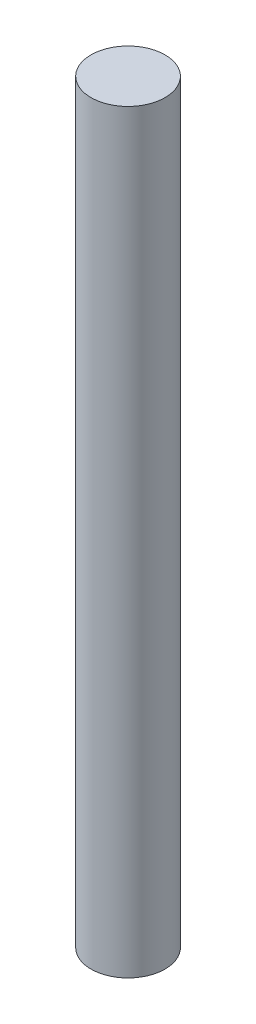
ISO-10303-21;
HEADER;
FILE_DESCRIPTION(('STEP AP214'),'2;1');
FILE_NAME('part.step','',(''),(''),'','','');
FILE_SCHEMA(('AUTOMOTIVE_DESIGN { 1 0 10303 214 1 1 1 1 }'));
ENDSEC;
DATA;
#1=APPLICATION_CONTEXT('core data for automotive mechanical design processes');
#2=APPLICATION_PROTOCOL_DEFINITION('international standard','automotive_design',2000,#1);
#3=PRODUCT_CONTEXT('',#1,'mechanical');
#4=PRODUCT('Part','Part','',(#3));
#5=PRODUCT_RELATED_PRODUCT_CATEGORY('part','',(#4));
#6=PRODUCT_DEFINITION_FORMATION('','',#4);
#7=PRODUCT_DEFINITION_CONTEXT('part definition',#1,'design');
#8=PRODUCT_DEFINITION('design','',#6,#7);
#9=PRODUCT_DEFINITION_SHAPE('','',#8);
#10=(LENGTH_UNIT() NAMED_UNIT(*) SI_UNIT(.MILLI.,.METRE.));
#11=(NAMED_UNIT(*) PLANE_ANGLE_UNIT() SI_UNIT($,.RADIAN.));
#12=(NAMED_UNIT(*) SI_UNIT($,.STERADIAN.) SOLID_ANGLE_UNIT());
#13=UNCERTAINTY_MEASURE_WITH_UNIT(LENGTH_MEASURE(1.E-05),#10,'distance_accuracy_value','');
#14=(GEOMETRIC_REPRESENTATION_CONTEXT(3) GLOBAL_UNCERTAINTY_ASSIGNED_CONTEXT((#13)) GLOBAL_UNIT_ASSIGNED_CONTEXT((#10,
#11,#12)) REPRESENTATION_CONTEXT('',''));
#15=CARTESIAN_POINT('',(0.,0.,0.));
#16=DIRECTION('',(0.,0.,1.));
#17=DIRECTION('',(1.,0.,0.));
#18=AXIS2_PLACEMENT_3D('',#15,#16,#17);
#19=CARTESIAN_POINT('',(0.,41.5,0.));
#20=DIRECTION('',(0.,-1.,0.));
#21=DIRECTION('',(0.,0.,-1.));
#22=AXIS2_PLACEMENT_3D('',#19,#20,#21);
#23=CYLINDRICAL_SURFACE('',#22,4.);
#24=CARTESIAN_POINT('',(0.,41.5,0.));
#25=DIRECTION('',(0.,-1.,0.));
#26=DIRECTION('',(0.,0.,-1.));
#27=AXIS2_PLACEMENT_3D('',#24,#25,#26);
#28=CIRCLE('',#27,4.);
#29=CARTESIAN_POINT('',(0.,41.5,-4.));
#30=VERTEX_POINT('',#29);
#31=EDGE_CURVE('E10',#30,#30,#28,.T.);
#32=ORIENTED_EDGE('',*,*,#31,.T.);
#33=EDGE_LOOP('',(#32));
#34=FACE_BOUND('',#33,.T.);
#35=CARTESIAN_POINT('',(0.,-40.,0.));
#36=DIRECTION('',(0.,-1.,0.));
#37=DIRECTION('',(0.,0.,-1.));
#38=AXIS2_PLACEMENT_3D('',#35,#36,#37);
#39=CIRCLE('',#38,4.);
#40=CARTESIAN_POINT('',(0.,-40.,-4.));
#41=VERTEX_POINT('',#40);
#42=EDGE_CURVE('E39',#41,#41,#39,.T.);
#43=ORIENTED_EDGE('',*,*,#42,.F.);
#44=EDGE_LOOP('',(#43));
#45=FACE_BOUND('',#44,.T.);
#46=ADVANCED_FACE('F33',(#34,#45),#23,.T.);
#47=CARTESIAN_POINT('',(4.,41.5,0.));
#48=DIRECTION('',(0.,1.,0.));
#49=DIRECTION('',(0.,0.,1.));
#50=AXIS2_PLACEMENT_3D('',#47,#48,#49);
#51=PLANE('',#50);
#52=ORIENTED_EDGE('',*,*,#31,.F.);
#53=EDGE_LOOP('',(#52));
#54=FACE_BOUND('',#53,.T.);
#55=ADVANCED_FACE('F48',(#54),#51,.T.);
#56=CARTESIAN_POINT('',(0.,-40.,0.));
#57=DIRECTION('',(0.,-1.,0.));
#58=DIRECTION('',(0.,0.,-1.));
#59=AXIS2_PLACEMENT_3D('',#56,#57,#58);
#60=PLANE('',#59);
#61=ORIENTED_EDGE('',*,*,#42,.T.);
#62=EDGE_LOOP('',(#61));
#63=FACE_BOUND('',#62,.T.);
#64=ADVANCED_FACE('F45',(#63),#60,.T.);
#65=CLOSED_SHELL('',(#46,#55,#64));
#66=MANIFOLD_SOLID_BREP('B2',#65);
#67=ADVANCED_BREP_SHAPE_REPRESENTATION('',(#18,#66),#14);
#68=SHAPE_DEFINITION_REPRESENTATION(#9,#67);
ENDSEC;
END-ISO-10303-21;
